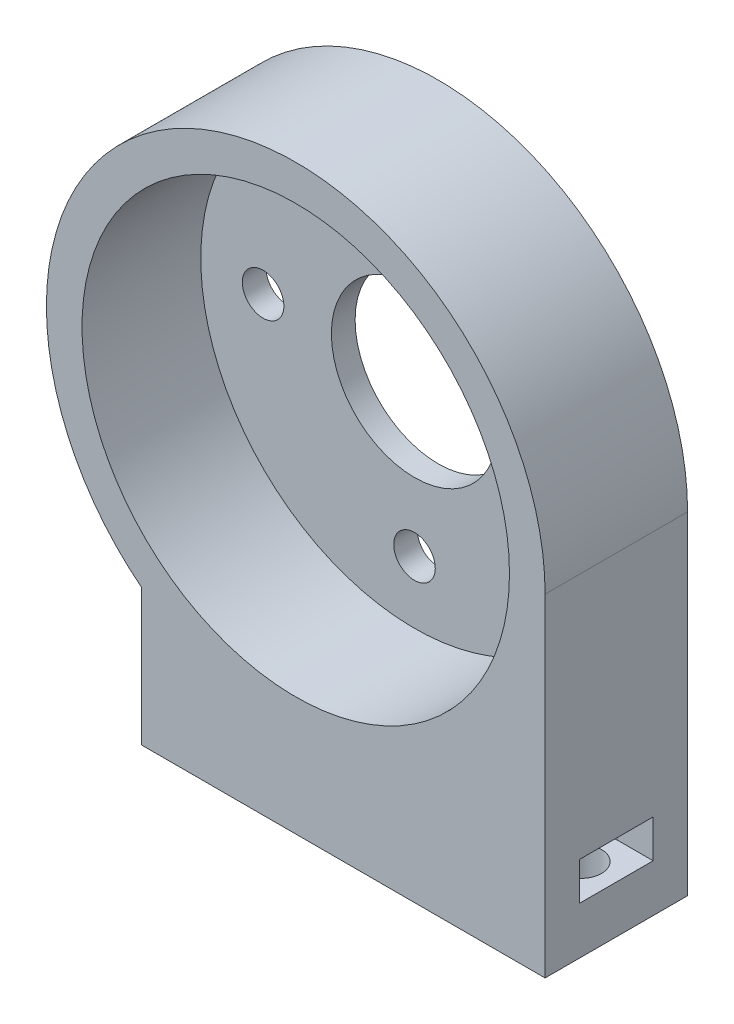
ISO-10303-21;
HEADER;
FILE_DESCRIPTION(('STEP AP214'),'2;1');
FILE_NAME('part.step','',(''),(''),'','','');
FILE_SCHEMA(('AUTOMOTIVE_DESIGN { 1 0 10303 214 1 1 1 1 }'));
ENDSEC;
DATA;
#1=APPLICATION_CONTEXT('core data for automotive mechanical design processes');
#2=APPLICATION_PROTOCOL_DEFINITION('international standard','automotive_design',2000,#1);
#3=PRODUCT_CONTEXT('',#1,'mechanical');
#4=PRODUCT('Part','Part','',(#3));
#5=PRODUCT_RELATED_PRODUCT_CATEGORY('part','',(#4));
#6=PRODUCT_DEFINITION_FORMATION('','',#4);
#7=PRODUCT_DEFINITION_CONTEXT('part definition',#1,'design');
#8=PRODUCT_DEFINITION('design','',#6,#7);
#9=PRODUCT_DEFINITION_SHAPE('','',#8);
#10=(LENGTH_UNIT() NAMED_UNIT(*) SI_UNIT(.MILLI.,.METRE.));
#11=(NAMED_UNIT(*) PLANE_ANGLE_UNIT() SI_UNIT($,.RADIAN.));
#12=(NAMED_UNIT(*) SI_UNIT($,.STERADIAN.) SOLID_ANGLE_UNIT());
#13=UNCERTAINTY_MEASURE_WITH_UNIT(LENGTH_MEASURE(1.E-05),#10,'distance_accuracy_value','');
#14=(GEOMETRIC_REPRESENTATION_CONTEXT(3) GLOBAL_UNCERTAINTY_ASSIGNED_CONTEXT((#13)) GLOBAL_UNIT_ASSIGNED_CONTEXT((#10,
#11,#12)) REPRESENTATION_CONTEXT('',''));
#15=CARTESIAN_POINT('',(0.,0.,0.));
#16=DIRECTION('',(0.,0.,1.));
#17=DIRECTION('',(1.,0.,0.));
#18=AXIS2_PLACEMENT_3D('',#15,#16,#17);
#19=CARTESIAN_POINT('',(-13.,-16.4924225024706,10.));
#20=DIRECTION('',(1.,0.,0.));
#21=DIRECTION('',(0.,1.,0.));
#22=AXIS2_PLACEMENT_3D('',#19,#20,#21);
#23=PLANE('',#22);
#24=DIRECTION('',(0.,0.,-1.));
#25=VECTOR('',#24,1.);
#26=CARTESIAN_POINT('',(-13.,-16.4924225024706,10.));
#27=LINE('',#26,#25);
#28=CARTESIAN_POINT('',(-13.,-16.4924225024706,10.));
#29=VERTEX_POINT('',#28);
#30=CARTESIAN_POINT('',(-13.,-16.4924225024706,-2.));
#31=VERTEX_POINT('',#30);
#32=EDGE_CURVE('E11',#29,#31,#27,.T.);
#33=ORIENTED_EDGE('',*,*,#32,.T.);
#34=DIRECTION('',(0.,-1.,0.));
#35=VECTOR('',#34,1.);
#36=CARTESIAN_POINT('',(-13.,0.,-2.));
#37=LINE('',#36,#35);
#38=CARTESIAN_POINT('',(-13.,-28.,-2.));
#39=VERTEX_POINT('',#38);
#40=EDGE_CURVE('E244',#31,#39,#37,.T.);
#41=ORIENTED_EDGE('',*,*,#40,.T.);
#42=DIRECTION('',(0.,0.,-1.));
#43=VECTOR('',#42,1.);
#44=CARTESIAN_POINT('',(-13.,-28.,10.));
#45=LINE('',#44,#43);
#46=CARTESIAN_POINT('',(-13.,-28.,10.));
#47=VERTEX_POINT('',#46);
#48=EDGE_CURVE('E45',#47,#39,#45,.T.);
#49=ORIENTED_EDGE('',*,*,#48,.F.);
#50=DIRECTION('',(0.,-1.,0.));
#51=VECTOR('',#50,1.);
#52=CARTESIAN_POINT('',(-13.,-16.4924225024706,10.));
#53=LINE('',#52,#51);
#54=EDGE_CURVE('E256',#29,#47,#53,.T.);
#55=ORIENTED_EDGE('',*,*,#54,.F.);
#56=EDGE_LOOP('',(#33,#41,#49,#55));
#57=FACE_BOUND('',#56,.T.);
#58=DIRECTION('',(0.,0.,-1.));
#59=VECTOR('',#58,1.);
#60=CARTESIAN_POINT('',(-13.,-20.8,0.9));
#61=LINE('',#60,#59);
#62=CARTESIAN_POINT('',(-13.,-20.8,7.1));
#63=VERTEX_POINT('',#62);
#64=CARTESIAN_POINT('',(-13.,-20.8,0.9));
#65=VERTEX_POINT('',#64);
#66=EDGE_CURVE('E192',#63,#65,#61,.T.);
#67=ORIENTED_EDGE('',*,*,#66,.F.);
#68=DIRECTION('',(0.,-1.,0.));
#69=VECTOR('',#68,1.);
#70=CARTESIAN_POINT('',(-13.,-20.8,7.1));
#71=LINE('',#70,#69);
#72=CARTESIAN_POINT('',(-13.,-24.,7.1));
#73=VERTEX_POINT('',#72);
#74=EDGE_CURVE('E173',#63,#73,#71,.T.);
#75=ORIENTED_EDGE('',*,*,#74,.T.);
#76=DIRECTION('',(0.,0.,-1.));
#77=VECTOR('',#76,1.);
#78=CARTESIAN_POINT('',(-13.,-24.,0.9));
#79=LINE('',#78,#77);
#80=CARTESIAN_POINT('',(-13.,-24.,0.9));
#81=VERTEX_POINT('',#80);
#82=EDGE_CURVE('E181',#73,#81,#79,.T.);
#83=ORIENTED_EDGE('',*,*,#82,.T.);
#84=DIRECTION('',(0.,-1.,0.));
#85=VECTOR('',#84,1.);
#86=CARTESIAN_POINT('',(-13.,-20.8,0.9));
#87=LINE('',#86,#85);
#88=EDGE_CURVE('E176',#65,#81,#87,.T.);
#89=ORIENTED_EDGE('',*,*,#88,.F.);
#90=EDGE_LOOP('',(#67,#75,#83,#89));
#91=FACE_BOUND('',#90,.T.);
#92=ADVANCED_FACE('F36',(#57,#91),#23,.F.);
#93=CARTESIAN_POINT('',(21.,-28.,10.));
#94=DIRECTION('',(-1.,0.,0.));
#95=DIRECTION('',(0.,0.,1.));
#96=AXIS2_PLACEMENT_3D('',#93,#94,#95);
#97=PLANE('',#96);
#98=DIRECTION('',(0.,0.,-1.));
#99=VECTOR('',#98,1.);
#100=CARTESIAN_POINT('',(21.,-28.,10.));
#101=LINE('',#100,#99);
#102=CARTESIAN_POINT('',(21.,-28.,10.));
#103=VERTEX_POINT('',#102);
#104=CARTESIAN_POINT('',(21.,-28.,-2.));
#105=VERTEX_POINT('',#104);
#106=EDGE_CURVE('E264',#103,#105,#101,.T.);
#107=ORIENTED_EDGE('',*,*,#106,.T.);
#108=DIRECTION('',(0.,1.,0.));
#109=VECTOR('',#108,1.);
#110=CARTESIAN_POINT('',(21.,0.,-2.));
#111=LINE('',#110,#109);
#112=CARTESIAN_POINT('',(21.,0.,-2.));
#113=VERTEX_POINT('',#112);
#114=EDGE_CURVE('E238',#105,#113,#111,.T.);
#115=ORIENTED_EDGE('',*,*,#114,.T.);
#116=DIRECTION('',(0.,0.,-1.));
#117=VECTOR('',#116,1.);
#118=CARTESIAN_POINT('',(21.,0.,10.));
#119=LINE('',#118,#117);
#120=CARTESIAN_POINT('',(21.,0.,10.));
#121=VERTEX_POINT('',#120);
#122=EDGE_CURVE('E262',#121,#113,#119,.T.);
#123=ORIENTED_EDGE('',*,*,#122,.F.);
#124=DIRECTION('',(0.,1.,0.));
#125=VECTOR('',#124,1.);
#126=CARTESIAN_POINT('',(21.,-28.,10.));
#127=LINE('',#126,#125);
#128=EDGE_CURVE('E260',#103,#121,#127,.T.);
#129=ORIENTED_EDGE('',*,*,#128,.F.);
#130=EDGE_LOOP('',(#107,#115,#123,#129));
#131=FACE_BOUND('',#130,.T.);
#132=DIRECTION('',(0.,0.,1.));
#133=VECTOR('',#132,1.);
#134=CARTESIAN_POINT('',(21.,-20.8,0.900000000000001));
#135=LINE('',#134,#133);
#136=CARTESIAN_POINT('',(21.,-20.8,0.900000000000001));
#137=VERTEX_POINT('',#136);
#138=CARTESIAN_POINT('',(21.,-20.8,7.1));
#139=VERTEX_POINT('',#138);
#140=EDGE_CURVE('E147',#137,#139,#135,.T.);
#141=ORIENTED_EDGE('',*,*,#140,.F.);
#142=DIRECTION('',(0.,-1.,0.));
#143=VECTOR('',#142,1.);
#144=CARTESIAN_POINT('',(21.,-20.8,0.900000000000001));
#145=LINE('',#144,#143);
#146=CARTESIAN_POINT('',(21.,-24.,0.900000000000001));
#147=VERTEX_POINT('',#146);
#148=EDGE_CURVE('E138',#137,#147,#145,.T.);
#149=ORIENTED_EDGE('',*,*,#148,.T.);
#150=DIRECTION('',(0.,0.,1.));
#151=VECTOR('',#150,1.);
#152=CARTESIAN_POINT('',(21.,-24.,0.900000000000001));
#153=LINE('',#152,#151);
#154=CARTESIAN_POINT('',(21.,-24.,7.1));
#155=VERTEX_POINT('',#154);
#156=EDGE_CURVE('E153',#147,#155,#153,.T.);
#157=ORIENTED_EDGE('',*,*,#156,.T.);
#158=DIRECTION('',(0.,-1.,0.));
#159=VECTOR('',#158,1.);
#160=CARTESIAN_POINT('',(21.,-20.8,7.1));
#161=LINE('',#160,#159);
#162=EDGE_CURVE('E167',#139,#155,#161,.T.);
#163=ORIENTED_EDGE('',*,*,#162,.F.);
#164=EDGE_LOOP('',(#141,#149,#157,#163));
#165=FACE_BOUND('',#164,.T.);
#166=ADVANCED_FACE('F295',(#131,#165),#97,.F.);
#167=CARTESIAN_POINT('',(0.,0.,10.));
#168=DIRECTION('',(0.,0.,1.));
#169=DIRECTION('',(1.,0.,0.));
#170=AXIS2_PLACEMENT_3D('',#167,#168,#169);
#171=PLANE('',#170);
#172=CARTESIAN_POINT('',(0.,0.,10.));
#173=DIRECTION('',(0.,0.,1.));
#174=DIRECTION('',(1.,0.,0.));
#175=AXIS2_PLACEMENT_3D('',#172,#173,#174);
#176=CIRCLE('',#175,21.);
#177=EDGE_CURVE('E251',#121,#29,#176,.T.);
#178=ORIENTED_EDGE('',*,*,#177,.T.);
#179=ORIENTED_EDGE('',*,*,#54,.T.);
#180=DIRECTION('',(1.,0.,0.));
#181=VECTOR('',#180,1.);
#182=CARTESIAN_POINT('',(-13.,-28.,10.));
#183=LINE('',#182,#181);
#184=EDGE_CURVE('E258',#47,#103,#183,.T.);
#185=ORIENTED_EDGE('',*,*,#184,.T.);
#186=ORIENTED_EDGE('',*,*,#128,.T.);
#187=EDGE_LOOP('',(#178,#179,#185,#186));
#188=FACE_BOUND('',#187,.T.);
#189=CARTESIAN_POINT('',(0.,0.,10.));
#190=DIRECTION('',(0.,0.,1.));
#191=DIRECTION('',(1.,0.,0.));
#192=AXIS2_PLACEMENT_3D('',#189,#190,#191);
#193=CIRCLE('',#192,18.);
#194=CARTESIAN_POINT('',(18.,0.,10.));
#195=VERTEX_POINT('',#194);
#196=EDGE_CURVE('E248',#195,#195,#193,.T.);
#197=ORIENTED_EDGE('',*,*,#196,.F.);
#198=EDGE_LOOP('',(#197));
#199=FACE_BOUND('',#198,.T.);
#200=ADVANCED_FACE('F300',(#188,#199),#171,.T.);
#201=CARTESIAN_POINT('',(0.,0.,10.));
#202=DIRECTION('',(0.,0.,-1.));
#203=DIRECTION('',(-1.,0.,0.));
#204=AXIS2_PLACEMENT_3D('',#201,#202,#203);
#205=CYLINDRICAL_SURFACE('',#204,21.);
#206=ORIENTED_EDGE('',*,*,#122,.T.);
#207=CARTESIAN_POINT('',(0.,0.,-2.));
#208=DIRECTION('',(0.,0.,1.));
#209=DIRECTION('',(1.,0.,0.));
#210=AXIS2_PLACEMENT_3D('',#207,#208,#209);
#211=CIRCLE('',#210,21.);
#212=EDGE_CURVE('E241',#113,#31,#211,.T.);
#213=ORIENTED_EDGE('',*,*,#212,.T.);
#214=ORIENTED_EDGE('',*,*,#32,.F.);
#215=ORIENTED_EDGE('',*,*,#177,.F.);
#216=EDGE_LOOP('',(#206,#213,#214,#215));
#217=FACE_BOUND('',#216,.T.);
#218=ADVANCED_FACE('F38',(#217),#205,.T.);
#219=CARTESIAN_POINT('',(-13.,-28.,10.));
#220=DIRECTION('',(0.,1.,0.));
#221=DIRECTION('',(-1.,0.,0.));
#222=AXIS2_PLACEMENT_3D('',#219,#220,#221);
#223=PLANE('',#222);
#224=CARTESIAN_POINT('',(-10.,-28.,4.));
#225=DIRECTION('',(0.,-1.,0.));
#226=DIRECTION('',(1.,0.,0.));
#227=AXIS2_PLACEMENT_3D('',#224,#225,#226);
#228=CIRCLE('',#227,1.75);
#229=CARTESIAN_POINT('',(-8.25,-28.,4.));
#230=VERTEX_POINT('',#229);
#231=EDGE_CURVE('E203',#230,#230,#228,.T.);
#232=ORIENTED_EDGE('',*,*,#231,.F.);
#233=EDGE_LOOP('',(#232));
#234=FACE_BOUND('',#233,.T.);
#235=CARTESIAN_POINT('',(18.,-28.,4.));
#236=DIRECTION('',(0.,-1.,0.));
#237=DIRECTION('',(1.,0.,0.));
#238=AXIS2_PLACEMENT_3D('',#235,#236,#237);
#239=CIRCLE('',#238,1.75);
#240=CARTESIAN_POINT('',(19.75,-28.,4.));
#241=VERTEX_POINT('',#240);
#242=EDGE_CURVE('E206',#241,#241,#239,.T.);
#243=ORIENTED_EDGE('',*,*,#242,.F.);
#244=EDGE_LOOP('',(#243));
#245=FACE_BOUND('',#244,.T.);
#246=ORIENTED_EDGE('',*,*,#48,.T.);
#247=DIRECTION('',(1.,0.,0.));
#248=VECTOR('',#247,1.);
#249=CARTESIAN_POINT('',(0.,-28.,-2.));
#250=LINE('',#249,#248);
#251=EDGE_CURVE('E233',#39,#105,#250,.T.);
#252=ORIENTED_EDGE('',*,*,#251,.T.);
#253=ORIENTED_EDGE('',*,*,#106,.F.);
#254=ORIENTED_EDGE('',*,*,#184,.F.);
#255=EDGE_LOOP('',(#246,#252,#253,#254));
#256=FACE_BOUND('',#255,.T.);
#257=ADVANCED_FACE('F305',(#234,#245,#256),#223,.F.);
#258=CARTESIAN_POINT('',(0.,0.,10.));
#259=DIRECTION('',(0.,0.,-1.));
#260=DIRECTION('',(-1.,0.,0.));
#261=AXIS2_PLACEMENT_3D('',#258,#259,#260);
#262=CYLINDRICAL_SURFACE('',#261,18.);
#263=ORIENTED_EDGE('',*,*,#196,.T.);
#264=EDGE_LOOP('',(#263));
#265=FACE_BOUND('',#264,.T.);
#266=CARTESIAN_POINT('',(0.,0.,0.));
#267=DIRECTION('',(0.,0.,1.));
#268=DIRECTION('',(1.,0.,0.));
#269=AXIS2_PLACEMENT_3D('',#266,#267,#268);
#270=CIRCLE('',#269,18.);
#271=CARTESIAN_POINT('',(18.,0.,0.));
#272=VERTEX_POINT('',#271);
#273=EDGE_CURVE('E247',#272,#272,#270,.T.);
#274=ORIENTED_EDGE('',*,*,#273,.F.);
#275=EDGE_LOOP('',(#274));
#276=FACE_BOUND('',#275,.T.);
#277=ADVANCED_FACE('F307',(#265,#276),#262,.F.);
#278=CARTESIAN_POINT('',(0.,0.,0.));
#279=DIRECTION('',(0.,0.,1.));
#280=DIRECTION('',(1.,0.,0.));
#281=AXIS2_PLACEMENT_3D('',#278,#279,#280);
#282=PLANE('',#281);
#283=CARTESIAN_POINT('',(0.,0.,0.));
#284=DIRECTION('',(0.,0.,1.));
#285=DIRECTION('',(1.,0.,0.));
#286=AXIS2_PLACEMENT_3D('',#283,#284,#285);
#287=CIRCLE('',#286,7.);
#288=CARTESIAN_POINT('',(7.,0.,0.));
#289=VERTEX_POINT('',#288);
#290=EDGE_CURVE('E227',#289,#289,#287,.T.);
#291=ORIENTED_EDGE('',*,*,#290,.F.);
#292=EDGE_LOOP('',(#291));
#293=FACE_BOUND('',#292,.T.);
#294=CARTESIAN_POINT('',(0.,12.75,0.));
#295=DIRECTION('',(0.,0.,1.));
#296=DIRECTION('',(1.,0.,0.));
#297=AXIS2_PLACEMENT_3D('',#294,#295,#296);
#298=CIRCLE('',#297,1.75);
#299=CARTESIAN_POINT('',(1.75,12.75,0.));
#300=VERTEX_POINT('',#299);
#301=EDGE_CURVE('E221',#300,#300,#298,.T.);
#302=ORIENTED_EDGE('',*,*,#301,.F.);
#303=EDGE_LOOP('',(#302));
#304=FACE_BOUND('',#303,.T.);
#305=CARTESIAN_POINT('',(-12.75,0.,0.));
#306=DIRECTION('',(0.,0.,1.));
#307=DIRECTION('',(1.,0.,0.));
#308=AXIS2_PLACEMENT_3D('',#305,#306,#307);
#309=CIRCLE('',#308,1.75);
#310=CARTESIAN_POINT('',(-11.,0.,0.));
#311=VERTEX_POINT('',#310);
#312=EDGE_CURVE('E215',#311,#311,#309,.T.);
#313=ORIENTED_EDGE('',*,*,#312,.F.);
#314=EDGE_LOOP('',(#313));
#315=FACE_BOUND('',#314,.T.);
#316=CARTESIAN_POINT('',(0.,-12.75,0.));
#317=DIRECTION('',(0.,0.,1.));
#318=DIRECTION('',(1.,0.,0.));
#319=AXIS2_PLACEMENT_3D('',#316,#317,#318);
#320=CIRCLE('',#319,1.75);
#321=CARTESIAN_POINT('',(1.75,-12.75,0.));
#322=VERTEX_POINT('',#321);
#323=EDGE_CURVE('E202',#322,#322,#320,.T.);
#324=ORIENTED_EDGE('',*,*,#323,.F.);
#325=EDGE_LOOP('',(#324));
#326=FACE_BOUND('',#325,.T.);
#327=ORIENTED_EDGE('',*,*,#273,.T.);
#328=EDGE_LOOP('',(#327));
#329=FACE_BOUND('',#328,.T.);
#330=ADVANCED_FACE('F315',(#293,#304,#315,#326,#329),#282,.T.);
#331=CARTESIAN_POINT('',(0.,0.,-2.));
#332=DIRECTION('',(0.,0.,1.));
#333=DIRECTION('',(1.,0.,0.));
#334=AXIS2_PLACEMENT_3D('',#331,#332,#333);
#335=PLANE('',#334);
#336=CARTESIAN_POINT('',(0.,-12.75,-2.));
#337=DIRECTION('',(0.,0.,1.));
#338=DIRECTION('',(1.,0.,0.));
#339=AXIS2_PLACEMENT_3D('',#336,#337,#338);
#340=CIRCLE('',#339,1.75);
#341=CARTESIAN_POINT('',(1.75,-12.75,-2.));
#342=VERTEX_POINT('',#341);
#343=EDGE_CURVE('E212',#342,#342,#340,.T.);
#344=ORIENTED_EDGE('',*,*,#343,.T.);
#345=EDGE_LOOP('',(#344));
#346=FACE_BOUND('',#345,.T.);
#347=CARTESIAN_POINT('',(-12.75,0.,-2.));
#348=DIRECTION('',(0.,0.,1.));
#349=DIRECTION('',(1.,0.,0.));
#350=AXIS2_PLACEMENT_3D('',#347,#348,#349);
#351=CIRCLE('',#350,1.75);
#352=CARTESIAN_POINT('',(-11.,0.,-2.));
#353=VERTEX_POINT('',#352);
#354=EDGE_CURVE('E218',#353,#353,#351,.T.);
#355=ORIENTED_EDGE('',*,*,#354,.T.);
#356=EDGE_LOOP('',(#355));
#357=FACE_BOUND('',#356,.T.);
#358=CARTESIAN_POINT('',(0.,12.75,-2.));
#359=DIRECTION('',(0.,0.,1.));
#360=DIRECTION('',(1.,0.,0.));
#361=AXIS2_PLACEMENT_3D('',#358,#359,#360);
#362=CIRCLE('',#361,1.75);
#363=CARTESIAN_POINT('',(1.75,12.75,-2.));
#364=VERTEX_POINT('',#363);
#365=EDGE_CURVE('E224',#364,#364,#362,.T.);
#366=ORIENTED_EDGE('',*,*,#365,.T.);
#367=EDGE_LOOP('',(#366));
#368=FACE_BOUND('',#367,.T.);
#369=CARTESIAN_POINT('',(0.,0.,-2.));
#370=DIRECTION('',(0.,0.,1.));
#371=DIRECTION('',(1.,0.,0.));
#372=AXIS2_PLACEMENT_3D('',#369,#370,#371);
#373=CIRCLE('',#372,7.);
#374=CARTESIAN_POINT('',(7.,0.,-2.));
#375=VERTEX_POINT('',#374);
#376=EDGE_CURVE('E230',#375,#375,#373,.T.);
#377=ORIENTED_EDGE('',*,*,#376,.T.);
#378=EDGE_LOOP('',(#377));
#379=FACE_BOUND('',#378,.T.);
#380=ORIENTED_EDGE('',*,*,#251,.F.);
#381=ORIENTED_EDGE('',*,*,#40,.F.);
#382=ORIENTED_EDGE('',*,*,#212,.F.);
#383=ORIENTED_EDGE('',*,*,#114,.F.);
#384=EDGE_LOOP('',(#380,#381,#382,#383));
#385=FACE_BOUND('',#384,.T.);
#386=ADVANCED_FACE('F319',(#346,#357,#368,#379,#385),#335,.F.);
#387=CARTESIAN_POINT('',(0.,0.,-2.));
#388=DIRECTION('',(0.,0.,1.));
#389=DIRECTION('',(1.,0.,0.));
#390=AXIS2_PLACEMENT_3D('',#387,#388,#389);
#391=CYLINDRICAL_SURFACE('',#390,7.);
#392=ORIENTED_EDGE('',*,*,#376,.F.);
#393=EDGE_LOOP('',(#392));
#394=FACE_BOUND('',#393,.T.);
#395=ORIENTED_EDGE('',*,*,#290,.T.);
#396=EDGE_LOOP('',(#395));
#397=FACE_BOUND('',#396,.T.);
#398=ADVANCED_FACE('F323',(#394,#397),#391,.F.);
#399=CARTESIAN_POINT('',(0.,12.75,-2.));
#400=DIRECTION('',(0.,0.,1.));
#401=DIRECTION('',(1.,0.,0.));
#402=AXIS2_PLACEMENT_3D('',#399,#400,#401);
#403=CYLINDRICAL_SURFACE('',#402,1.75);
#404=ORIENTED_EDGE('',*,*,#365,.F.);
#405=EDGE_LOOP('',(#404));
#406=FACE_BOUND('',#405,.T.);
#407=ORIENTED_EDGE('',*,*,#301,.T.);
#408=EDGE_LOOP('',(#407));
#409=FACE_BOUND('',#408,.T.);
#410=ADVANCED_FACE('F327',(#406,#409),#403,.F.);
#411=CARTESIAN_POINT('',(-12.75,0.,-2.));
#412=DIRECTION('',(0.,0.,1.));
#413=DIRECTION('',(1.,0.,0.));
#414=AXIS2_PLACEMENT_3D('',#411,#412,#413);
#415=CYLINDRICAL_SURFACE('',#414,1.75);
#416=ORIENTED_EDGE('',*,*,#354,.F.);
#417=EDGE_LOOP('',(#416));
#418=FACE_BOUND('',#417,.T.);
#419=ORIENTED_EDGE('',*,*,#312,.T.);
#420=EDGE_LOOP('',(#419));
#421=FACE_BOUND('',#420,.T.);
#422=ADVANCED_FACE('F331',(#418,#421),#415,.F.);
#423=CARTESIAN_POINT('',(0.,-12.75,-2.));
#424=DIRECTION('',(0.,0.,1.));
#425=DIRECTION('',(1.,0.,0.));
#426=AXIS2_PLACEMENT_3D('',#423,#424,#425);
#427=CYLINDRICAL_SURFACE('',#426,1.75);
#428=ORIENTED_EDGE('',*,*,#343,.F.);
#429=EDGE_LOOP('',(#428));
#430=FACE_BOUND('',#429,.T.);
#431=ORIENTED_EDGE('',*,*,#323,.T.);
#432=EDGE_LOOP('',(#431));
#433=FACE_BOUND('',#432,.T.);
#434=ADVANCED_FACE('F293',(#430,#433),#427,.F.);
#435=CARTESIAN_POINT('',(18.,-20.,4.));
#436=DIRECTION('',(0.,-1.,0.));
#437=DIRECTION('',(1.,0.,0.));
#438=AXIS2_PLACEMENT_3D('',#435,#436,#437);
#439=CYLINDRICAL_SURFACE('',#438,1.75);
#440=CARTESIAN_POINT('',(18.,-24.,4.));
#441=DIRECTION('',(0.,-1.,0.));
#442=DIRECTION('',(1.,0.,0.));
#443=AXIS2_PLACEMENT_3D('',#440,#441,#442);
#444=CIRCLE('',#443,1.75);
#445=CARTESIAN_POINT('',(19.75,-24.,4.));
#446=VERTEX_POINT('',#445);
#447=EDGE_CURVE('E271',#446,#446,#444,.F.);
#448=ORIENTED_EDGE('',*,*,#447,.T.);
#449=EDGE_LOOP('',(#448));
#450=FACE_BOUND('',#449,.T.);
#451=ORIENTED_EDGE('',*,*,#242,.T.);
#452=EDGE_LOOP('',(#451));
#453=FACE_BOUND('',#452,.T.);
#454=ADVANCED_FACE('F283',(#450,#453),#439,.F.);
#455=CARTESIAN_POINT('',(-10.,-20.,4.));
#456=DIRECTION('',(0.,-1.,0.));
#457=DIRECTION('',(1.,0.,0.));
#458=AXIS2_PLACEMENT_3D('',#455,#456,#457);
#459=CYLINDRICAL_SURFACE('',#458,1.75);
#460=CARTESIAN_POINT('',(-10.,-24.,4.));
#461=DIRECTION('',(0.,-1.,0.));
#462=DIRECTION('',(1.,0.,0.));
#463=AXIS2_PLACEMENT_3D('',#460,#461,#462);
#464=CIRCLE('',#463,1.75);
#465=CARTESIAN_POINT('',(-8.25,-24.,4.));
#466=VERTEX_POINT('',#465);
#467=EDGE_CURVE('E166',#466,#466,#464,.F.);
#468=ORIENTED_EDGE('',*,*,#467,.T.);
#469=EDGE_LOOP('',(#468));
#470=FACE_BOUND('',#469,.T.);
#471=ORIENTED_EDGE('',*,*,#231,.T.);
#472=EDGE_LOOP('',(#471));
#473=FACE_BOUND('',#472,.T.);
#474=ADVANCED_FACE('F292',(#470,#473),#459,.F.);
#475=CARTESIAN_POINT('',(-10.,-20.8,4.));
#476=DIRECTION('',(0.,-1.,0.));
#477=DIRECTION('',(1.,0.,0.));
#478=AXIS2_PLACEMENT_3D('',#475,#476,#477);
#479=PLANE('',#478);
#480=CARTESIAN_POINT('',(-10.,-20.8,4.));
#481=DIRECTION('',(0.,-1.,0.));
#482=DIRECTION('',(1.,0.,0.));
#483=AXIS2_PLACEMENT_3D('',#480,#481,#482);
#484=CIRCLE('',#483,3.1);
#485=CARTESIAN_POINT('',(-10.,-20.8,0.9));
#486=VERTEX_POINT('',#485);
#487=CARTESIAN_POINT('',(-10.,-20.8,7.1));
#488=VERTEX_POINT('',#487);
#489=EDGE_CURVE('E182',#486,#488,#484,.T.);
#490=ORIENTED_EDGE('',*,*,#489,.T.);
#491=DIRECTION('',(-1.,0.,0.));
#492=VECTOR('',#491,1.);
#493=CARTESIAN_POINT('',(-10.,-20.8,7.1));
#494=LINE('',#493,#492);
#495=EDGE_CURVE('E194',#488,#63,#494,.T.);
#496=ORIENTED_EDGE('',*,*,#495,.T.);
#497=ORIENTED_EDGE('',*,*,#66,.T.);
#498=DIRECTION('',(1.,0.,0.));
#499=VECTOR('',#498,1.);
#500=CARTESIAN_POINT('',(-10.,-20.8,0.9));
#501=LINE('',#500,#499);
#502=EDGE_CURVE('E172',#65,#486,#501,.T.);
#503=ORIENTED_EDGE('',*,*,#502,.T.);
#504=EDGE_LOOP('',(#490,#496,#497,#503));
#505=FACE_BOUND('',#504,.T.);
#506=CARTESIAN_POINT('',(-10.,-20.8,4.));
#507=DIRECTION('',(0.,-1.,0.));
#508=DIRECTION('',(1.,0.,0.));
#509=AXIS2_PLACEMENT_3D('',#506,#507,#508);
#510=CIRCLE('',#509,1.75);
#511=CARTESIAN_POINT('',(-8.25,-20.8,4.));
#512=VERTEX_POINT('',#511);
#513=EDGE_CURVE('E269',#512,#512,#510,.F.);
#514=ORIENTED_EDGE('',*,*,#513,.T.);
#515=EDGE_LOOP('',(#514));
#516=FACE_BOUND('',#515,.T.);
#517=ADVANCED_FACE('F405',(#505,#516),#479,.T.);
#518=CARTESIAN_POINT('',(-10.,-24.,4.));
#519=DIRECTION('',(0.,-1.,0.));
#520=DIRECTION('',(1.,0.,0.));
#521=AXIS2_PLACEMENT_3D('',#518,#519,#520);
#522=PLANE('',#521);
#523=CARTESIAN_POINT('',(-10.,-24.,4.));
#524=DIRECTION('',(0.,-1.,0.));
#525=DIRECTION('',(1.,0.,0.));
#526=AXIS2_PLACEMENT_3D('',#523,#524,#525);
#527=CIRCLE('',#526,3.1);
#528=CARTESIAN_POINT('',(-10.,-24.,0.9));
#529=VERTEX_POINT('',#528);
#530=CARTESIAN_POINT('',(-10.,-24.,7.1));
#531=VERTEX_POINT('',#530);
#532=EDGE_CURVE('E160',#529,#531,#527,.T.);
#533=ORIENTED_EDGE('',*,*,#532,.F.);
#534=DIRECTION('',(1.,0.,0.));
#535=VECTOR('',#534,1.);
#536=CARTESIAN_POINT('',(-10.,-24.,0.9));
#537=LINE('',#536,#535);
#538=EDGE_CURVE('E53',#81,#529,#537,.T.);
#539=ORIENTED_EDGE('',*,*,#538,.F.);
#540=ORIENTED_EDGE('',*,*,#82,.F.);
#541=DIRECTION('',(-1.,0.,0.));
#542=VECTOR('',#541,1.);
#543=CARTESIAN_POINT('',(-10.,-24.,7.1));
#544=LINE('',#543,#542);
#545=EDGE_CURVE('E185',#531,#73,#544,.T.);
#546=ORIENTED_EDGE('',*,*,#545,.F.);
#547=EDGE_LOOP('',(#533,#539,#540,#546));
#548=FACE_BOUND('',#547,.T.);
#549=ORIENTED_EDGE('',*,*,#467,.F.);
#550=EDGE_LOOP('',(#549));
#551=FACE_BOUND('',#550,.T.);
#552=ADVANCED_FACE('F393',(#548,#551),#522,.F.);
#553=CARTESIAN_POINT('',(-10.,-20.8,4.));
#554=DIRECTION('',(0.,-1.,0.));
#555=DIRECTION('',(1.,0.,0.));
#556=AXIS2_PLACEMENT_3D('',#553,#554,#555);
#557=CYLINDRICAL_SURFACE('',#556,3.1);
#558=ORIENTED_EDGE('',*,*,#532,.T.);
#559=DIRECTION('',(0.,-1.,0.));
#560=VECTOR('',#559,1.);
#561=CARTESIAN_POINT('',(-10.,-20.8,7.1));
#562=LINE('',#561,#560);
#563=EDGE_CURVE('E170',#488,#531,#562,.T.);
#564=ORIENTED_EDGE('',*,*,#563,.F.);
#565=ORIENTED_EDGE('',*,*,#489,.F.);
#566=DIRECTION('',(0.,-1.,0.));
#567=VECTOR('',#566,1.);
#568=CARTESIAN_POINT('',(-10.,-20.8,0.9));
#569=LINE('',#568,#567);
#570=EDGE_CURVE('E178',#486,#529,#569,.T.);
#571=ORIENTED_EDGE('',*,*,#570,.T.);
#572=EDGE_LOOP('',(#558,#564,#565,#571));
#573=FACE_BOUND('',#572,.T.);
#574=ADVANCED_FACE('F389',(#573),#557,.F.);
#575=CARTESIAN_POINT('',(-10.,-20.8,0.9));
#576=DIRECTION('',(0.,0.,-1.));
#577=DIRECTION('',(-1.,0.,0.));
#578=AXIS2_PLACEMENT_3D('',#575,#576,#577);
#579=PLANE('',#578);
#580=ORIENTED_EDGE('',*,*,#538,.T.);
#581=ORIENTED_EDGE('',*,*,#570,.F.);
#582=ORIENTED_EDGE('',*,*,#502,.F.);
#583=ORIENTED_EDGE('',*,*,#88,.T.);
#584=EDGE_LOOP('',(#580,#581,#582,#583));
#585=FACE_BOUND('',#584,.T.);
#586=ADVANCED_FACE('F392',(#585),#579,.F.);
#587=CARTESIAN_POINT('',(-10.,-20.8,7.1));
#588=DIRECTION('',(0.,0.,1.));
#589=DIRECTION('',(1.,0.,0.));
#590=AXIS2_PLACEMENT_3D('',#587,#588,#589);
#591=PLANE('',#590);
#592=ORIENTED_EDGE('',*,*,#545,.T.);
#593=ORIENTED_EDGE('',*,*,#74,.F.);
#594=ORIENTED_EDGE('',*,*,#495,.F.);
#595=ORIENTED_EDGE('',*,*,#563,.T.);
#596=EDGE_LOOP('',(#592,#593,#594,#595));
#597=FACE_BOUND('',#596,.T.);
#598=ADVANCED_FACE('F395',(#597),#591,.F.);
#599=CARTESIAN_POINT('',(-10.,-20.,4.));
#600=DIRECTION('',(0.,-1.,0.));
#601=DIRECTION('',(1.,0.,0.));
#602=AXIS2_PLACEMENT_3D('',#599,#600,#601);
#603=PLANE('',#602);
#604=CARTESIAN_POINT('',(-10.,-20.,4.));
#605=DIRECTION('',(0.,-1.,0.));
#606=DIRECTION('',(1.,0.,0.));
#607=AXIS2_PLACEMENT_3D('',#604,#605,#606);
#608=CIRCLE('',#607,1.75);
#609=CARTESIAN_POINT('',(-8.25,-20.,4.));
#610=VERTEX_POINT('',#609);
#611=EDGE_CURVE('E199',#610,#610,#608,.T.);
#612=ORIENTED_EDGE('',*,*,#611,.T.);
#613=EDGE_LOOP('',(#612));
#614=FACE_BOUND('',#613,.T.);
#615=ADVANCED_FACE('F398',(#614),#603,.T.);
#616=ORIENTED_EDGE('',*,*,#611,.F.);
#617=EDGE_LOOP('',(#616));
#618=FACE_BOUND('',#617,.T.);
#619=ORIENTED_EDGE('',*,*,#513,.F.);
#620=EDGE_LOOP('',(#619));
#621=FACE_BOUND('',#620,.T.);
#622=ADVANCED_FACE('F382',(#618,#621),#459,.F.);
#623=CARTESIAN_POINT('',(18.,-20.8,4.));
#624=DIRECTION('',(0.,-1.,0.));
#625=DIRECTION('',(1.,0.,0.));
#626=AXIS2_PLACEMENT_3D('',#623,#624,#625);
#627=PLANE('',#626);
#628=CARTESIAN_POINT('',(18.,-20.8,4.));
#629=DIRECTION('',(0.,-1.,0.));
#630=DIRECTION('',(1.,0.,0.));
#631=AXIS2_PLACEMENT_3D('',#628,#629,#630);
#632=CIRCLE('',#631,3.1);
#633=CARTESIAN_POINT('',(18.,-20.8,7.1));
#634=VERTEX_POINT('',#633);
#635=CARTESIAN_POINT('',(18.,-20.8,0.9));
#636=VERTEX_POINT('',#635);
#637=EDGE_CURVE('E132',#634,#636,#632,.T.);
#638=ORIENTED_EDGE('',*,*,#637,.T.);
#639=DIRECTION('',(1.,0.,0.));
#640=VECTOR('',#639,1.);
#641=CARTESIAN_POINT('',(18.,-20.8,0.9));
#642=LINE('',#641,#640);
#643=EDGE_CURVE('E142',#636,#137,#642,.T.);
#644=ORIENTED_EDGE('',*,*,#643,.T.);
#645=ORIENTED_EDGE('',*,*,#140,.T.);
#646=DIRECTION('',(-1.,0.,0.));
#647=VECTOR('',#646,1.);
#648=CARTESIAN_POINT('',(18.,-20.8,7.1));
#649=LINE('',#648,#647);
#650=EDGE_CURVE('E139',#139,#634,#649,.T.);
#651=ORIENTED_EDGE('',*,*,#650,.T.);
#652=EDGE_LOOP('',(#638,#644,#645,#651));
#653=FACE_BOUND('',#652,.T.);
#654=CARTESIAN_POINT('',(18.,-20.8,4.));
#655=DIRECTION('',(0.,-1.,0.));
#656=DIRECTION('',(1.,0.,0.));
#657=AXIS2_PLACEMENT_3D('',#654,#655,#656);
#658=CIRCLE('',#657,1.75);
#659=CARTESIAN_POINT('',(19.75,-20.8,4.));
#660=VERTEX_POINT('',#659);
#661=EDGE_CURVE('E40',#660,#660,#658,.F.);
#662=ORIENTED_EDGE('',*,*,#661,.T.);
#663=EDGE_LOOP('',(#662));
#664=FACE_BOUND('',#663,.T.);
#665=ADVANCED_FACE('F149',(#653,#664),#627,.T.);
#666=CARTESIAN_POINT('',(18.,-24.,4.));
#667=DIRECTION('',(0.,-1.,0.));
#668=DIRECTION('',(1.,0.,0.));
#669=AXIS2_PLACEMENT_3D('',#666,#667,#668);
#670=PLANE('',#669);
#671=CARTESIAN_POINT('',(18.,-24.,4.));
#672=DIRECTION('',(0.,-1.,0.));
#673=DIRECTION('',(1.,0.,0.));
#674=AXIS2_PLACEMENT_3D('',#671,#672,#673);
#675=CIRCLE('',#674,3.1);
#676=CARTESIAN_POINT('',(18.,-24.,7.1));
#677=VERTEX_POINT('',#676);
#678=CARTESIAN_POINT('',(18.,-24.,0.9));
#679=VERTEX_POINT('',#678);
#680=EDGE_CURVE('E134',#677,#679,#675,.T.);
#681=ORIENTED_EDGE('',*,*,#680,.F.);
#682=DIRECTION('',(-1.,0.,0.));
#683=VECTOR('',#682,1.);
#684=CARTESIAN_POINT('',(18.,-24.,7.1));
#685=LINE('',#684,#683);
#686=EDGE_CURVE('E61',#155,#677,#685,.T.);
#687=ORIENTED_EDGE('',*,*,#686,.F.);
#688=ORIENTED_EDGE('',*,*,#156,.F.);
#689=DIRECTION('',(1.,0.,0.));
#690=VECTOR('',#689,1.);
#691=CARTESIAN_POINT('',(18.,-24.,0.9));
#692=LINE('',#691,#690);
#693=EDGE_CURVE('E159',#679,#147,#692,.T.);
#694=ORIENTED_EDGE('',*,*,#693,.F.);
#695=EDGE_LOOP('',(#681,#687,#688,#694));
#696=FACE_BOUND('',#695,.T.);
#697=ORIENTED_EDGE('',*,*,#447,.F.);
#698=EDGE_LOOP('',(#697));
#699=FACE_BOUND('',#698,.T.);
#700=ADVANCED_FACE('F373',(#696,#699),#670,.F.);
#701=CARTESIAN_POINT('',(18.,-20.8,4.));
#702=DIRECTION('',(0.,-1.,0.));
#703=DIRECTION('',(1.,0.,0.));
#704=AXIS2_PLACEMENT_3D('',#701,#702,#703);
#705=CYLINDRICAL_SURFACE('',#704,3.1);
#706=ORIENTED_EDGE('',*,*,#680,.T.);
#707=DIRECTION('',(0.,-1.,0.));
#708=VECTOR('',#707,1.);
#709=CARTESIAN_POINT('',(18.,-20.8,0.9));
#710=LINE('',#709,#708);
#711=EDGE_CURVE('E128',#636,#679,#710,.T.);
#712=ORIENTED_EDGE('',*,*,#711,.F.);
#713=ORIENTED_EDGE('',*,*,#637,.F.);
#714=DIRECTION('',(0.,-1.,0.));
#715=VECTOR('',#714,1.);
#716=CARTESIAN_POINT('',(18.,-20.8,7.1));
#717=LINE('',#716,#715);
#718=EDGE_CURVE('E164',#634,#677,#717,.T.);
#719=ORIENTED_EDGE('',*,*,#718,.T.);
#720=EDGE_LOOP('',(#706,#712,#713,#719));
#721=FACE_BOUND('',#720,.T.);
#722=ADVANCED_FACE('F130',(#721),#705,.F.);
#723=CARTESIAN_POINT('',(18.,-20.8,7.1));
#724=DIRECTION('',(0.,0.,1.));
#725=DIRECTION('',(1.,0.,0.));
#726=AXIS2_PLACEMENT_3D('',#723,#724,#725);
#727=PLANE('',#726);
#728=ORIENTED_EDGE('',*,*,#686,.T.);
#729=ORIENTED_EDGE('',*,*,#718,.F.);
#730=ORIENTED_EDGE('',*,*,#650,.F.);
#731=ORIENTED_EDGE('',*,*,#162,.T.);
#732=EDGE_LOOP('',(#728,#729,#730,#731));
#733=FACE_BOUND('',#732,.T.);
#734=ADVANCED_FACE('F372',(#733),#727,.F.);
#735=CARTESIAN_POINT('',(18.,-20.8,0.9));
#736=DIRECTION('',(0.,0.,-1.));
#737=DIRECTION('',(-1.,0.,0.));
#738=AXIS2_PLACEMENT_3D('',#735,#736,#737);
#739=PLANE('',#738);
#740=ORIENTED_EDGE('',*,*,#693,.T.);
#741=ORIENTED_EDGE('',*,*,#148,.F.);
#742=ORIENTED_EDGE('',*,*,#643,.F.);
#743=ORIENTED_EDGE('',*,*,#711,.T.);
#744=EDGE_LOOP('',(#740,#741,#742,#743));
#745=FACE_BOUND('',#744,.T.);
#746=ADVANCED_FACE('F143',(#745),#739,.F.);
#747=CARTESIAN_POINT('',(18.,-20.,4.));
#748=DIRECTION('',(0.,-1.,0.));
#749=DIRECTION('',(1.,0.,0.));
#750=AXIS2_PLACEMENT_3D('',#747,#748,#749);
#751=PLANE('',#750);
#752=CARTESIAN_POINT('',(18.,-20.,4.));
#753=DIRECTION('',(0.,-1.,0.));
#754=DIRECTION('',(1.,0.,0.));
#755=AXIS2_PLACEMENT_3D('',#752,#753,#754);
#756=CIRCLE('',#755,1.75);
#757=CARTESIAN_POINT('',(19.75,-20.,4.));
#758=VERTEX_POINT('',#757);
#759=EDGE_CURVE('E209',#758,#758,#756,.T.);
#760=ORIENTED_EDGE('',*,*,#759,.T.);
#761=EDGE_LOOP('',(#760));
#762=FACE_BOUND('',#761,.T.);
#763=ADVANCED_FACE('F280',(#762),#751,.T.);
#764=ORIENTED_EDGE('',*,*,#759,.F.);
#765=EDGE_LOOP('',(#764));
#766=FACE_BOUND('',#765,.T.);
#767=ORIENTED_EDGE('',*,*,#661,.F.);
#768=EDGE_LOOP('',(#767));
#769=FACE_BOUND('',#768,.T.);
#770=ADVANCED_FACE('F278',(#766,#769),#439,.F.);
#771=CLOSED_SHELL('',(#92,#166,#200,#218,#257,#277,#330,#386,#398,#410,#422,#434,#454,#474,#517,
#552,#574,#586,#598,#615,#622,#665,#700,#722,#734,#746,#763,#770));
#772=MANIFOLD_SOLID_BREP('B2',#771);
#773=ADVANCED_BREP_SHAPE_REPRESENTATION('',(#18,#772),#14);
#774=SHAPE_DEFINITION_REPRESENTATION(#9,#773);
ENDSEC;
END-ISO-10303-21;
